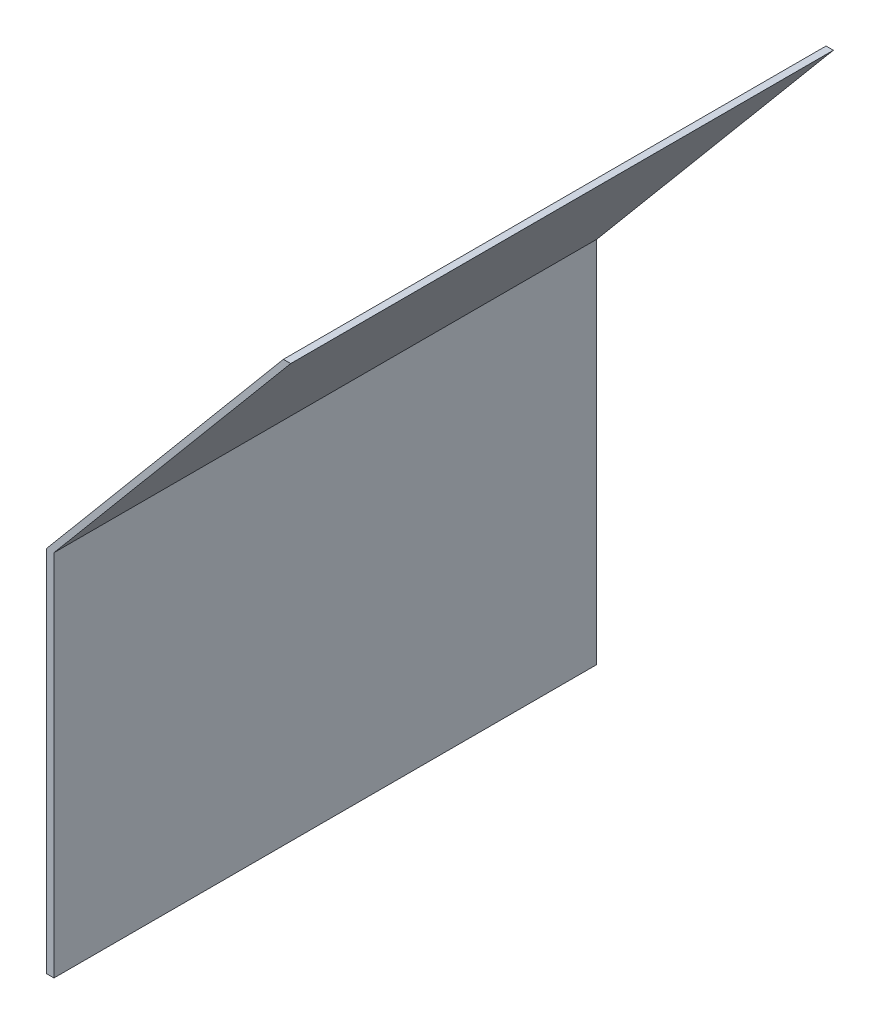
ISO-10303-21;
HEADER;
FILE_DESCRIPTION(('STEP AP214'),'2;1');
FILE_NAME('part.step','',(''),(''),'','','');
FILE_SCHEMA(('AUTOMOTIVE_DESIGN { 1 0 10303 214 1 1 1 1 }'));
ENDSEC;
DATA;
#1=APPLICATION_CONTEXT('core data for automotive mechanical design processes');
#2=APPLICATION_PROTOCOL_DEFINITION('international standard','automotive_design',2000,#1);
#3=PRODUCT_CONTEXT('',#1,'mechanical');
#4=PRODUCT('Part','Part','',(#3));
#5=PRODUCT_RELATED_PRODUCT_CATEGORY('part','',(#4));
#6=PRODUCT_DEFINITION_FORMATION('','',#4);
#7=PRODUCT_DEFINITION_CONTEXT('part definition',#1,'design');
#8=PRODUCT_DEFINITION('design','',#6,#7);
#9=PRODUCT_DEFINITION_SHAPE('','',#8);
#10=(LENGTH_UNIT() NAMED_UNIT(*) SI_UNIT(.MILLI.,.METRE.));
#11=(NAMED_UNIT(*) PLANE_ANGLE_UNIT() SI_UNIT($,.RADIAN.));
#12=(NAMED_UNIT(*) SI_UNIT($,.STERADIAN.) SOLID_ANGLE_UNIT());
#13=UNCERTAINTY_MEASURE_WITH_UNIT(LENGTH_MEASURE(1.E-05),#10,'distance_accuracy_value','');
#14=(GEOMETRIC_REPRESENTATION_CONTEXT(3) GLOBAL_UNCERTAINTY_ASSIGNED_CONTEXT((#13)) GLOBAL_UNIT_ASSIGNED_CONTEXT((#10,
#11,#12)) REPRESENTATION_CONTEXT('',''));
#15=CARTESIAN_POINT('',(0.,0.,0.));
#16=DIRECTION('',(0.,0.,1.));
#17=DIRECTION('',(1.,0.,0.));
#18=AXIS2_PLACEMENT_3D('',#15,#16,#17);
#19=CARTESIAN_POINT('',(0.,76.2,112.268));
#20=DIRECTION('',(1.,0.,0.));
#21=DIRECTION('',(0.,1.,0.));
#22=AXIS2_PLACEMENT_3D('',#19,#20,#21);
#23=PLANE('',#22);
#24=DIRECTION('',(0.,-1.,0.));
#25=VECTOR('',#24,1.);
#26=CARTESIAN_POINT('',(0.,76.2,0.));
#27=LINE('',#26,#25);
#28=CARTESIAN_POINT('',(0.,76.2,0.));
#29=VERTEX_POINT('',#28);
#30=CARTESIAN_POINT('',(0.,0.,0.));
#31=VERTEX_POINT('',#30);
#32=EDGE_CURVE('E118',#29,#31,#27,.T.);
#33=ORIENTED_EDGE('',*,*,#32,.T.);
#34=DIRECTION('',(0.,0.,-1.));
#35=VECTOR('',#34,1.);
#36=CARTESIAN_POINT('',(0.,0.,112.268));
#37=LINE('',#36,#35);
#38=CARTESIAN_POINT('',(0.,0.,112.268));
#39=VERTEX_POINT('',#38);
#40=EDGE_CURVE('E11',#39,#31,#37,.T.);
#41=ORIENTED_EDGE('',*,*,#40,.F.);
#42=DIRECTION('',(0.,-1.,0.));
#43=VECTOR('',#42,1.);
#44=CARTESIAN_POINT('',(0.,76.2,112.268));
#45=LINE('',#44,#43);
#46=CARTESIAN_POINT('',(0.,76.2,112.268));
#47=VERTEX_POINT('',#46);
#48=EDGE_CURVE('E128',#47,#39,#45,.T.);
#49=ORIENTED_EDGE('',*,*,#48,.F.);
#50=DIRECTION('',(0.,0.,-1.));
#51=VECTOR('',#50,1.);
#52=CARTESIAN_POINT('',(0.,76.2,112.268));
#53=LINE('',#52,#51);
#54=EDGE_CURVE('E114',#47,#29,#53,.T.);
#55=ORIENTED_EDGE('',*,*,#54,.T.);
#56=EDGE_LOOP('',(#33,#41,#49,#55));
#57=FACE_BOUND('',#56,.T.);
#58=ADVANCED_FACE('F34',(#57),#23,.F.);
#59=CARTESIAN_POINT('',(0.,0.,112.268));
#60=DIRECTION('',(0.,1.,0.));
#61=DIRECTION('',(0.,0.,1.));
#62=AXIS2_PLACEMENT_3D('',#59,#60,#61);
#63=PLANE('',#62);
#64=DIRECTION('',(1.,0.,0.));
#65=VECTOR('',#64,1.);
#66=CARTESIAN_POINT('',(0.,0.,0.));
#67=LINE('',#66,#65);
#68=CARTESIAN_POINT('',(1.51892,0.,0.));
#69=VERTEX_POINT('',#68);
#70=EDGE_CURVE('E121',#31,#69,#67,.T.);
#71=ORIENTED_EDGE('',*,*,#70,.T.);
#72=DIRECTION('',(0.,0.,-1.));
#73=VECTOR('',#72,1.);
#74=CARTESIAN_POINT('',(1.51892,0.,112.268));
#75=LINE('',#74,#73);
#76=CARTESIAN_POINT('',(1.51892,0.,112.268));
#77=VERTEX_POINT('',#76);
#78=EDGE_CURVE('E42',#77,#69,#75,.T.);
#79=ORIENTED_EDGE('',*,*,#78,.F.);
#80=DIRECTION('',(1.,0.,0.));
#81=VECTOR('',#80,1.);
#82=CARTESIAN_POINT('',(0.,0.,112.268));
#83=LINE('',#82,#81);
#84=EDGE_CURVE('E87',#39,#77,#83,.T.);
#85=ORIENTED_EDGE('',*,*,#84,.F.);
#86=ORIENTED_EDGE('',*,*,#40,.T.);
#87=EDGE_LOOP('',(#71,#79,#85,#86));
#88=FACE_BOUND('',#87,.T.);
#89=ADVANCED_FACE('F152',(#88),#63,.F.);
#90=CARTESIAN_POINT('',(1.51892,0.,112.268));
#91=DIRECTION('',(-1.,0.,0.));
#92=DIRECTION('',(0.,-1.,0.));
#93=AXIS2_PLACEMENT_3D('',#90,#91,#92);
#94=PLANE('',#93);
#95=DIRECTION('',(0.,1.,0.));
#96=VECTOR('',#95,1.);
#97=CARTESIAN_POINT('',(1.51892,0.,0.));
#98=LINE('',#97,#96);
#99=CARTESIAN_POINT('',(1.51892,76.2,0.));
#100=VERTEX_POINT('',#99);
#101=EDGE_CURVE('E123',#69,#100,#98,.T.);
#102=ORIENTED_EDGE('',*,*,#101,.T.);
#103=DIRECTION('',(0.,0.,-1.));
#104=VECTOR('',#103,1.);
#105=CARTESIAN_POINT('',(1.51892,76.2,112.268));
#106=LINE('',#105,#104);
#107=CARTESIAN_POINT('',(1.51892,76.2,112.268));
#108=VERTEX_POINT('',#107);
#109=EDGE_CURVE('E109',#108,#100,#106,.T.);
#110=ORIENTED_EDGE('',*,*,#109,.F.);
#111=DIRECTION('',(0.,1.,0.));
#112=VECTOR('',#111,1.);
#113=CARTESIAN_POINT('',(1.51892,0.,112.268));
#114=LINE('',#113,#112);
#115=EDGE_CURVE('E100',#77,#108,#114,.T.);
#116=ORIENTED_EDGE('',*,*,#115,.F.);
#117=ORIENTED_EDGE('',*,*,#78,.T.);
#118=EDGE_LOOP('',(#102,#110,#116,#117));
#119=FACE_BOUND('',#118,.T.);
#120=ADVANCED_FACE('F134',(#119),#94,.F.);
#121=CARTESIAN_POINT('',(1.51892,76.2,112.268));
#122=DIRECTION('',(-0.766044443118977,0.64278760968654,0.));
#123=DIRECTION('',(-0.64278760968654,-0.766044443118977,0.));
#124=AXIS2_PLACEMENT_3D('',#121,#122,#123);
#125=PLANE('',#124);
#126=DIRECTION('',(0.64278760968654,0.766044443118977,0.));
#127=VECTOR('',#126,1.);
#128=CARTESIAN_POINT('',(1.51892,76.2,0.));
#129=LINE('',#128,#127);
#130=CARTESIAN_POINT('',(50.4993358581144,134.572586565666,0.));
#131=VERTEX_POINT('',#130);
#132=EDGE_CURVE('E108',#100,#131,#129,.T.);
#133=ORIENTED_EDGE('',*,*,#132,.T.);
#134=DIRECTION('',(0.,0.,-1.));
#135=VECTOR('',#134,1.);
#136=CARTESIAN_POINT('',(50.4993358581144,134.572586565666,112.268));
#137=LINE('',#136,#135);
#138=CARTESIAN_POINT('',(50.4993358581144,134.572586565666,112.268));
#139=VERTEX_POINT('',#138);
#140=EDGE_CURVE('E105',#139,#131,#137,.T.);
#141=ORIENTED_EDGE('',*,*,#140,.F.);
#142=DIRECTION('',(0.64278760968654,0.766044443118977,0.));
#143=VECTOR('',#142,1.);
#144=CARTESIAN_POINT('',(1.51892,76.2,112.268));
#145=LINE('',#144,#143);
#146=EDGE_CURVE('E94',#108,#139,#145,.T.);
#147=ORIENTED_EDGE('',*,*,#146,.F.);
#148=ORIENTED_EDGE('',*,*,#109,.T.);
#149=EDGE_LOOP('',(#133,#141,#147,#148));
#150=FACE_BOUND('',#149,.T.);
#151=ADVANCED_FACE('F106',(#150),#125,.F.);
#152=CARTESIAN_POINT('',(50.4993358581144,134.572586565666,112.268));
#153=DIRECTION('',(0.,-1.,0.));
#154=DIRECTION('',(0.,0.,-1.));
#155=AXIS2_PLACEMENT_3D('',#152,#153,#154);
#156=PLANE('',#155);
#157=DIRECTION('',(-1.,0.,0.));
#158=VECTOR('',#157,1.);
#159=CARTESIAN_POINT('',(50.4993358581144,134.572586565666,0.));
#160=LINE('',#159,#158);
#161=CARTESIAN_POINT('',(48.9804158581144,134.572586565666,0.));
#162=VERTEX_POINT('',#161);
#163=EDGE_CURVE('E73',#131,#162,#160,.T.);
#164=ORIENTED_EDGE('',*,*,#163,.T.);
#165=DIRECTION('',(0.,0.,-1.));
#166=VECTOR('',#165,1.);
#167=CARTESIAN_POINT('',(48.9804158581144,134.572586565666,112.268));
#168=LINE('',#167,#166);
#169=CARTESIAN_POINT('',(48.9804158581144,134.572586565666,112.268));
#170=VERTEX_POINT('',#169);
#171=EDGE_CURVE('E110',#170,#162,#168,.T.);
#172=ORIENTED_EDGE('',*,*,#171,.F.);
#173=DIRECTION('',(-1.,0.,0.));
#174=VECTOR('',#173,1.);
#175=CARTESIAN_POINT('',(50.4993358581144,134.572586565666,112.268));
#176=LINE('',#175,#174);
#177=EDGE_CURVE('E98',#139,#170,#176,.T.);
#178=ORIENTED_EDGE('',*,*,#177,.F.);
#179=ORIENTED_EDGE('',*,*,#140,.T.);
#180=EDGE_LOOP('',(#164,#172,#178,#179));
#181=FACE_BOUND('',#180,.T.);
#182=ADVANCED_FACE('F112',(#181),#156,.F.);
#183=CARTESIAN_POINT('',(48.9804158581144,134.572586565666,112.268));
#184=DIRECTION('',(0.766044443118977,-0.64278760968654,0.));
#185=DIRECTION('',(0.64278760968654,0.766044443118977,0.));
#186=AXIS2_PLACEMENT_3D('',#183,#184,#185);
#187=PLANE('',#186);
#188=DIRECTION('',(-0.64278760968654,-0.766044443118977,0.));
#189=VECTOR('',#188,1.);
#190=CARTESIAN_POINT('',(48.9804158581144,134.572586565666,0.));
#191=LINE('',#190,#189);
#192=EDGE_CURVE('E79',#162,#29,#191,.T.);
#193=ORIENTED_EDGE('',*,*,#192,.T.);
#194=ORIENTED_EDGE('',*,*,#54,.F.);
#195=DIRECTION('',(-0.64278760968654,-0.766044443118977,0.));
#196=VECTOR('',#195,1.);
#197=CARTESIAN_POINT('',(48.9804158581144,134.572586565666,112.268));
#198=LINE('',#197,#196);
#199=EDGE_CURVE('E50',#170,#47,#198,.T.);
#200=ORIENTED_EDGE('',*,*,#199,.F.);
#201=ORIENTED_EDGE('',*,*,#171,.T.);
#202=EDGE_LOOP('',(#193,#194,#200,#201));
#203=FACE_BOUND('',#202,.T.);
#204=ADVANCED_FACE('F141',(#203),#187,.F.);
#205=CARTESIAN_POINT('',(0.,0.,112.268));
#206=DIRECTION('',(0.,0.,1.));
#207=DIRECTION('',(1.,0.,0.));
#208=AXIS2_PLACEMENT_3D('',#205,#206,#207);
#209=PLANE('',#208);
#210=ORIENTED_EDGE('',*,*,#48,.T.);
#211=ORIENTED_EDGE('',*,*,#84,.T.);
#212=ORIENTED_EDGE('',*,*,#115,.T.);
#213=ORIENTED_EDGE('',*,*,#146,.T.);
#214=ORIENTED_EDGE('',*,*,#177,.T.);
#215=ORIENTED_EDGE('',*,*,#199,.T.);
#216=EDGE_LOOP('',(#210,#211,#212,#213,#214,#215));
#217=FACE_BOUND('',#216,.T.);
#218=ADVANCED_FACE('F96',(#217),#209,.T.);
#219=CARTESIAN_POINT('',(0.,0.,0.));
#220=DIRECTION('',(0.,0.,1.));
#221=DIRECTION('',(1.,0.,0.));
#222=AXIS2_PLACEMENT_3D('',#219,#220,#221);
#223=PLANE('',#222);
#224=ORIENTED_EDGE('',*,*,#32,.F.);
#225=ORIENTED_EDGE('',*,*,#192,.F.);
#226=ORIENTED_EDGE('',*,*,#163,.F.);
#227=ORIENTED_EDGE('',*,*,#132,.F.);
#228=ORIENTED_EDGE('',*,*,#101,.F.);
#229=ORIENTED_EDGE('',*,*,#70,.F.);
#230=EDGE_LOOP('',(#224,#225,#226,#227,#228,#229));
#231=FACE_BOUND('',#230,.T.);
#232=ADVANCED_FACE('F137',(#231),#223,.F.);
#233=CLOSED_SHELL('',(#58,#89,#120,#151,#182,#204,#218,#232));
#234=MANIFOLD_SOLID_BREP('B2',#233);
#235=ADVANCED_BREP_SHAPE_REPRESENTATION('',(#18,#234),#14);
#236=SHAPE_DEFINITION_REPRESENTATION(#9,#235);
ENDSEC;
END-ISO-10303-21;
